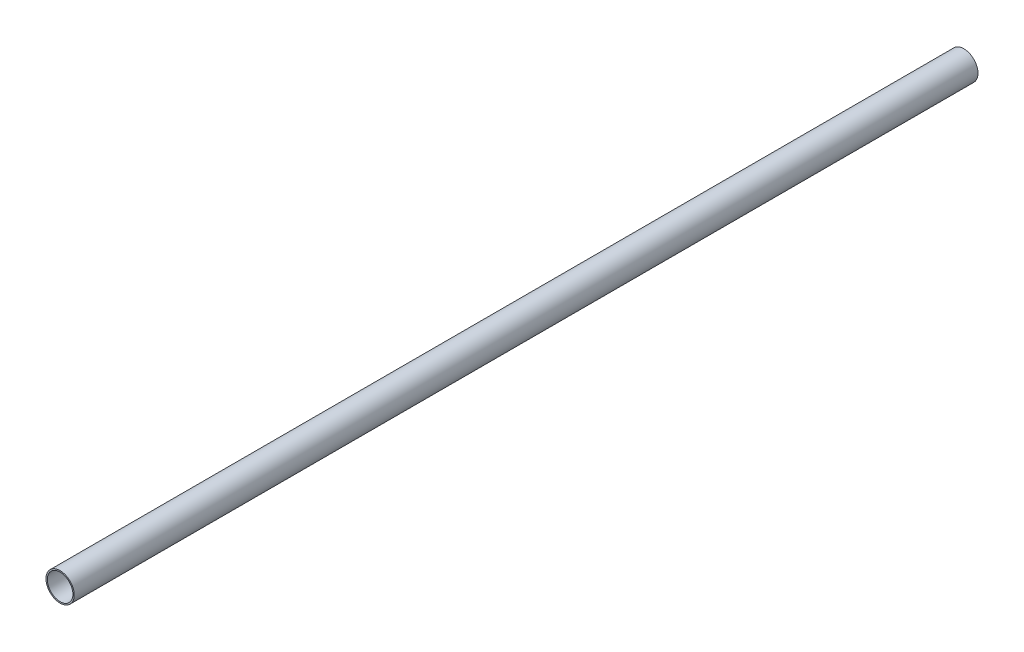
ISO-10303-21;
HEADER;
FILE_DESCRIPTION(('STEP AP214'),'2;1');
FILE_NAME('part.step','',(''),(''),'','','');
FILE_SCHEMA(('AUTOMOTIVE_DESIGN { 1 0 10303 214 1 1 1 1 }'));
ENDSEC;
DATA;
#1=APPLICATION_CONTEXT('core data for automotive mechanical design processes');
#2=APPLICATION_PROTOCOL_DEFINITION('international standard','automotive_design',2000,#1);
#3=PRODUCT_CONTEXT('',#1,'mechanical');
#4=PRODUCT('Part','Part','',(#3));
#5=PRODUCT_RELATED_PRODUCT_CATEGORY('part','',(#4));
#6=PRODUCT_DEFINITION_FORMATION('','',#4);
#7=PRODUCT_DEFINITION_CONTEXT('part definition',#1,'design');
#8=PRODUCT_DEFINITION('design','',#6,#7);
#9=PRODUCT_DEFINITION_SHAPE('','',#8);
#10=(LENGTH_UNIT() NAMED_UNIT(*) SI_UNIT(.MILLI.,.METRE.));
#11=(NAMED_UNIT(*) PLANE_ANGLE_UNIT() SI_UNIT($,.RADIAN.));
#12=(NAMED_UNIT(*) SI_UNIT($,.STERADIAN.) SOLID_ANGLE_UNIT());
#13=UNCERTAINTY_MEASURE_WITH_UNIT(LENGTH_MEASURE(1.E-05),#10,'distance_accuracy_value','');
#14=(GEOMETRIC_REPRESENTATION_CONTEXT(3) GLOBAL_UNCERTAINTY_ASSIGNED_CONTEXT((#13)) GLOBAL_UNIT_ASSIGNED_CONTEXT((#10,
#11,#12)) REPRESENTATION_CONTEXT('',''));
#15=CARTESIAN_POINT('',(0.,0.,0.));
#16=DIRECTION('',(0.,0.,1.));
#17=DIRECTION('',(1.,0.,0.));
#18=AXIS2_PLACEMENT_3D('',#15,#16,#17);
#19=CARTESIAN_POINT('',(0.,0.,304.8));
#20=DIRECTION('',(0.,0.,1.));
#21=DIRECTION('',(1.,0.,0.));
#22=AXIS2_PLACEMENT_3D('',#19,#20,#21);
#23=PLANE('',#22);
#24=CARTESIAN_POINT('',(0.,0.,304.8));
#25=DIRECTION('',(0.,0.,1.));
#26=DIRECTION('',(1.,0.,0.));
#27=AXIS2_PLACEMENT_3D('',#24,#25,#26);
#28=CIRCLE('',#27,4.7625);
#29=CARTESIAN_POINT('',(4.7625,0.,304.8));
#30=VERTEX_POINT('',#29);
#31=EDGE_CURVE('E10',#30,#30,#28,.T.);
#32=ORIENTED_EDGE('',*,*,#31,.T.);
#33=EDGE_LOOP('',(#32));
#34=FACE_BOUND('',#33,.T.);
#35=CARTESIAN_POINT('',(0.,0.,304.8));
#36=DIRECTION('',(0.,0.,1.));
#37=DIRECTION('',(1.,0.,0.));
#38=AXIS2_PLACEMENT_3D('',#35,#36,#37);
#39=CIRCLE('',#38,4.318);
#40=CARTESIAN_POINT('',(4.318,0.,304.8));
#41=VERTEX_POINT('',#40);
#42=EDGE_CURVE('E50',#41,#41,#39,.T.);
#43=ORIENTED_EDGE('',*,*,#42,.F.);
#44=EDGE_LOOP('',(#43));
#45=FACE_BOUND('',#44,.T.);
#46=ADVANCED_FACE('F37',(#34,#45),#23,.T.);
#47=CARTESIAN_POINT('',(0.,0.,0.));
#48=DIRECTION('',(0.,0.,1.));
#49=DIRECTION('',(1.,0.,0.));
#50=AXIS2_PLACEMENT_3D('',#47,#48,#49);
#51=PLANE('',#50);
#52=CARTESIAN_POINT('',(0.,0.,0.));
#53=DIRECTION('',(0.,0.,1.));
#54=DIRECTION('',(1.,0.,0.));
#55=AXIS2_PLACEMENT_3D('',#52,#53,#54);
#56=CIRCLE('',#55,4.7625);
#57=CARTESIAN_POINT('',(4.7625,0.,0.));
#58=VERTEX_POINT('',#57);
#59=EDGE_CURVE('E41',#58,#58,#56,.T.);
#60=ORIENTED_EDGE('',*,*,#59,.F.);
#61=EDGE_LOOP('',(#60));
#62=FACE_BOUND('',#61,.T.);
#63=CARTESIAN_POINT('',(0.,0.,0.));
#64=DIRECTION('',(0.,0.,1.));
#65=DIRECTION('',(1.,0.,0.));
#66=AXIS2_PLACEMENT_3D('',#63,#64,#65);
#67=CIRCLE('',#66,4.318);
#68=CARTESIAN_POINT('',(4.318,0.,0.));
#69=VERTEX_POINT('',#68);
#70=EDGE_CURVE('E52',#69,#69,#67,.T.);
#71=ORIENTED_EDGE('',*,*,#70,.T.);
#72=EDGE_LOOP('',(#71));
#73=FACE_BOUND('',#72,.T.);
#74=ADVANCED_FACE('F64',(#62,#73),#51,.F.);
#75=CARTESIAN_POINT('',(0.,0.,304.8));
#76=DIRECTION('',(0.,0.,-1.));
#77=DIRECTION('',(-1.,0.,0.));
#78=AXIS2_PLACEMENT_3D('',#75,#76,#77);
#79=CYLINDRICAL_SURFACE('',#78,4.7625);
#80=ORIENTED_EDGE('',*,*,#31,.F.);
#81=EDGE_LOOP('',(#80));
#82=FACE_BOUND('',#81,.T.);
#83=ORIENTED_EDGE('',*,*,#59,.T.);
#84=EDGE_LOOP('',(#83));
#85=FACE_BOUND('',#84,.T.);
#86=ADVANCED_FACE('F39',(#82,#85),#79,.T.);
#87=CARTESIAN_POINT('',(0.,0.,304.8));
#88=DIRECTION('',(0.,0.,-1.));
#89=DIRECTION('',(-1.,0.,0.));
#90=AXIS2_PLACEMENT_3D('',#87,#88,#89);
#91=CYLINDRICAL_SURFACE('',#90,4.318);
#92=ORIENTED_EDGE('',*,*,#42,.T.);
#93=EDGE_LOOP('',(#92));
#94=FACE_BOUND('',#93,.T.);
#95=ORIENTED_EDGE('',*,*,#70,.F.);
#96=EDGE_LOOP('',(#95));
#97=FACE_BOUND('',#96,.T.);
#98=ADVANCED_FACE('F60',(#94,#97),#91,.F.);
#99=CLOSED_SHELL('',(#46,#74,#86,#98));
#100=MANIFOLD_SOLID_BREP('B2',#99);
#101=ADVANCED_BREP_SHAPE_REPRESENTATION('',(#18,#100),#14);
#102=SHAPE_DEFINITION_REPRESENTATION(#9,#101);
ENDSEC;
END-ISO-10303-21;
